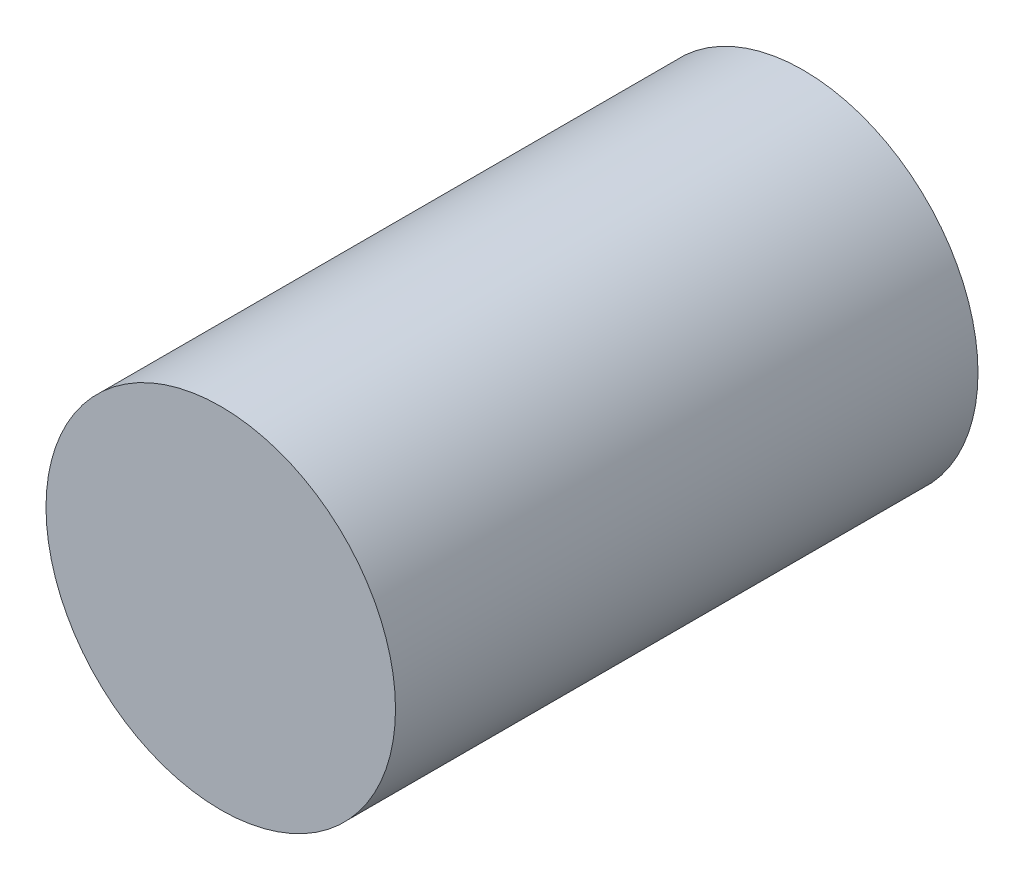
ISO-10303-21;
HEADER;
FILE_DESCRIPTION(('STEP AP214'),'2;1');
FILE_NAME('part.step','',(''),(''),'','','');
FILE_SCHEMA(('AUTOMOTIVE_DESIGN { 1 0 10303 214 1 1 1 1 }'));
ENDSEC;
DATA;
#1=APPLICATION_CONTEXT('core data for automotive mechanical design processes');
#2=APPLICATION_PROTOCOL_DEFINITION('international standard','automotive_design',2000,#1);
#3=PRODUCT_CONTEXT('',#1,'mechanical');
#4=PRODUCT('Part','Part','',(#3));
#5=PRODUCT_RELATED_PRODUCT_CATEGORY('part','',(#4));
#6=PRODUCT_DEFINITION_FORMATION('','',#4);
#7=PRODUCT_DEFINITION_CONTEXT('part definition',#1,'design');
#8=PRODUCT_DEFINITION('design','',#6,#7);
#9=PRODUCT_DEFINITION_SHAPE('','',#8);
#10=(LENGTH_UNIT() NAMED_UNIT(*) SI_UNIT(.MILLI.,.METRE.));
#11=(NAMED_UNIT(*) PLANE_ANGLE_UNIT() SI_UNIT($,.RADIAN.));
#12=(NAMED_UNIT(*) SI_UNIT($,.STERADIAN.) SOLID_ANGLE_UNIT());
#13=UNCERTAINTY_MEASURE_WITH_UNIT(LENGTH_MEASURE(1.E-05),#10,'distance_accuracy_value','');
#14=(GEOMETRIC_REPRESENTATION_CONTEXT(3) GLOBAL_UNCERTAINTY_ASSIGNED_CONTEXT((#13)) GLOBAL_UNIT_ASSIGNED_CONTEXT((#10,
#11,#12)) REPRESENTATION_CONTEXT('',''));
#15=CARTESIAN_POINT('',(0.,0.,0.));
#16=DIRECTION('',(0.,0.,1.));
#17=DIRECTION('',(1.,0.,0.));
#18=AXIS2_PLACEMENT_3D('',#15,#16,#17);
#19=CARTESIAN_POINT('',(0.,0.,50.));
#20=DIRECTION('',(0.,0.,-1.));
#21=DIRECTION('',(-1.,0.,0.));
#22=AXIS2_PLACEMENT_3D('',#19,#20,#21);
#23=CYLINDRICAL_SURFACE('',#22,15.);
#24=CARTESIAN_POINT('',(0.,0.,50.));
#25=DIRECTION('',(0.,0.,1.));
#26=DIRECTION('',(1.,0.,0.));
#27=AXIS2_PLACEMENT_3D('',#24,#25,#26);
#28=CIRCLE('',#27,15.);
#29=CARTESIAN_POINT('',(15.,0.,50.));
#30=VERTEX_POINT('',#29);
#31=EDGE_CURVE('E10',#30,#30,#28,.T.);
#32=ORIENTED_EDGE('',*,*,#31,.F.);
#33=EDGE_LOOP('',(#32));
#34=FACE_BOUND('',#33,.T.);
#35=CARTESIAN_POINT('',(0.,0.,0.));
#36=DIRECTION('',(0.,0.,1.));
#37=DIRECTION('',(1.,0.,0.));
#38=AXIS2_PLACEMENT_3D('',#35,#36,#37);
#39=CIRCLE('',#38,15.);
#40=CARTESIAN_POINT('',(15.,0.,0.));
#41=VERTEX_POINT('',#40);
#42=EDGE_CURVE('E33',#41,#41,#39,.T.);
#43=ORIENTED_EDGE('',*,*,#42,.T.);
#44=EDGE_LOOP('',(#43));
#45=FACE_BOUND('',#44,.T.);
#46=ADVANCED_FACE('F30',(#34,#45),#23,.T.);
#47=CARTESIAN_POINT('',(0.,0.,50.));
#48=DIRECTION('',(0.,0.,1.));
#49=DIRECTION('',(1.,0.,0.));
#50=AXIS2_PLACEMENT_3D('',#47,#48,#49);
#51=PLANE('',#50);
#52=ORIENTED_EDGE('',*,*,#31,.T.);
#53=EDGE_LOOP('',(#52));
#54=FACE_BOUND('',#53,.T.);
#55=ADVANCED_FACE('F45',(#54),#51,.T.);
#56=CARTESIAN_POINT('',(0.,0.,0.));
#57=DIRECTION('',(0.,0.,1.));
#58=DIRECTION('',(1.,0.,0.));
#59=AXIS2_PLACEMENT_3D('',#56,#57,#58);
#60=PLANE('',#59);
#61=ORIENTED_EDGE('',*,*,#42,.F.);
#62=EDGE_LOOP('',(#61));
#63=FACE_BOUND('',#62,.T.);
#64=ADVANCED_FACE('F43',(#63),#60,.F.);
#65=CLOSED_SHELL('',(#46,#55,#64));
#66=MANIFOLD_SOLID_BREP('B2',#65);
#67=ADVANCED_BREP_SHAPE_REPRESENTATION('',(#18,#66),#14);
#68=SHAPE_DEFINITION_REPRESENTATION(#9,#67);
ENDSEC;
END-ISO-10303-21;
